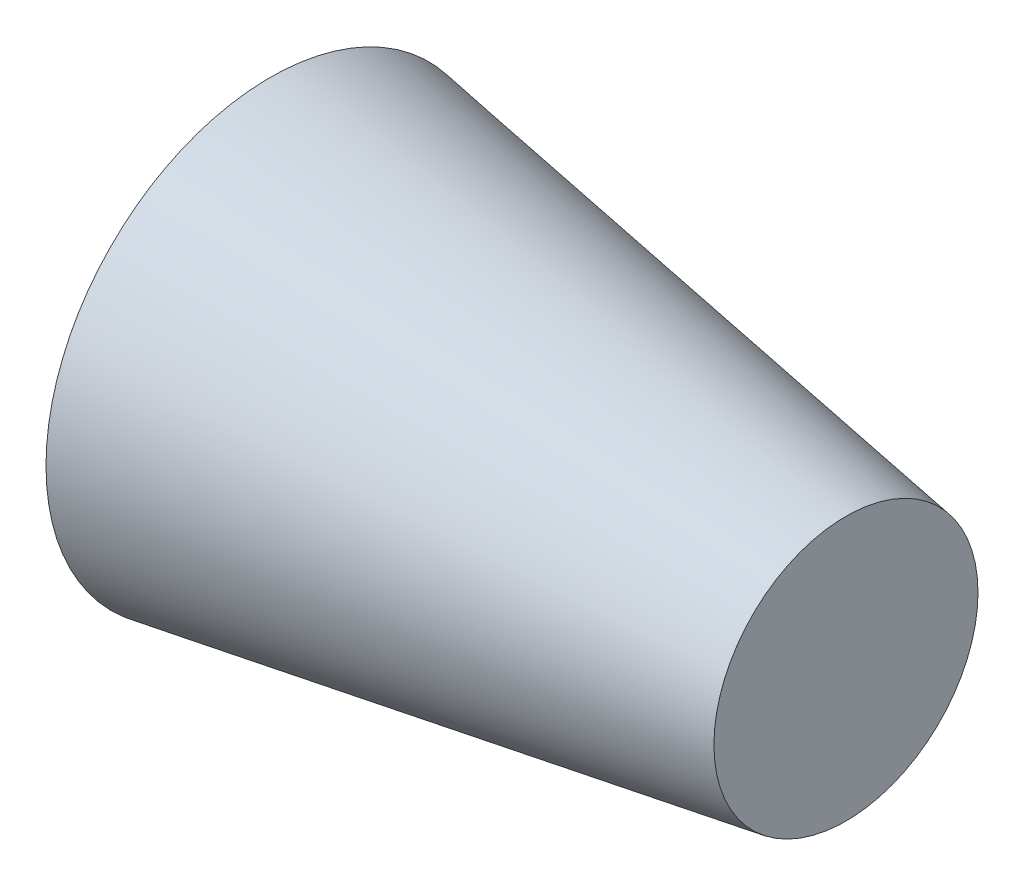
ISO-10303-21;
HEADER;
FILE_DESCRIPTION(('STEP AP214'),'2;1');
FILE_NAME('part.step','',(''),(''),'','','');
FILE_SCHEMA(('AUTOMOTIVE_DESIGN { 1 0 10303 214 1 1 1 1 }'));
ENDSEC;
DATA;
#1=APPLICATION_CONTEXT('core data for automotive mechanical design processes');
#2=APPLICATION_PROTOCOL_DEFINITION('international standard','automotive_design',2000,#1);
#3=PRODUCT_CONTEXT('',#1,'mechanical');
#4=PRODUCT('Part','Part','',(#3));
#5=PRODUCT_RELATED_PRODUCT_CATEGORY('part','',(#4));
#6=PRODUCT_DEFINITION_FORMATION('','',#4);
#7=PRODUCT_DEFINITION_CONTEXT('part definition',#1,'design');
#8=PRODUCT_DEFINITION('design','',#6,#7);
#9=PRODUCT_DEFINITION_SHAPE('','',#8);
#10=(LENGTH_UNIT() NAMED_UNIT(*) SI_UNIT(.MILLI.,.METRE.));
#11=(NAMED_UNIT(*) PLANE_ANGLE_UNIT() SI_UNIT($,.RADIAN.));
#12=(NAMED_UNIT(*) SI_UNIT($,.STERADIAN.) SOLID_ANGLE_UNIT());
#13=UNCERTAINTY_MEASURE_WITH_UNIT(LENGTH_MEASURE(1.E-05),#10,'distance_accuracy_value','');
#14=(GEOMETRIC_REPRESENTATION_CONTEXT(3) GLOBAL_UNCERTAINTY_ASSIGNED_CONTEXT((#13)) GLOBAL_UNIT_ASSIGNED_CONTEXT((#10,
#11,#12)) REPRESENTATION_CONTEXT('',''));
#15=CARTESIAN_POINT('',(0.,0.,0.));
#16=DIRECTION('',(0.,0.,1.));
#17=DIRECTION('',(1.,0.,0.));
#18=AXIS2_PLACEMENT_3D('',#15,#16,#17);
#19=CARTESIAN_POINT('',(17192.2398666314,0.,0.));
#20=DIRECTION('',(1.,0.,0.));
#21=DIRECTION('',(0.,0.,-1.));
#22=AXIS2_PLACEMENT_3D('',#19,#20,#21);
#23=PLANE('',#22);
#24=CARTESIAN_POINT('',(17192.2398666314,163.108100160094,0.));
#25=DIRECTION('',(-1.,0.,0.));
#26=DIRECTION('',(0.,0.,1.));
#27=AXIS2_PLACEMENT_3D('',#24,#25,#26);
#28=CIRCLE('',#27,1130.49401701701);
#29=CARTESIAN_POINT('',(17192.2398666314,163.108100160094,1130.49401701701));
#30=VERTEX_POINT('',#29);
#31=EDGE_CURVE('E37',#30,#30,#28,.T.);
#32=ORIENTED_EDGE('',*,*,#31,.T.);
#33=EDGE_LOOP('',(#32));
#34=FACE_BOUND('',#33,.T.);
#35=ADVANCED_FACE('F31',(#34),#23,.F.);
#36=CARTESIAN_POINT('',(20094.5354869192,0.,0.));
#37=DIRECTION('',(-1.,0.,0.));
#38=DIRECTION('',(0.,0.,1.));
#39=AXIS2_PLACEMENT_3D('',#36,#37,#38);
#40=PLANE('',#39);
#41=CARTESIAN_POINT('',(20094.5354869192,163.108100160094,0.));
#42=DIRECTION('',(-1.,0.,0.));
#43=DIRECTION('',(0.,0.,1.));
#44=AXIS2_PLACEMENT_3D('',#41,#42,#43);
#45=CIRCLE('',#44,665.656656286857);
#46=CARTESIAN_POINT('',(20094.5354869192,163.108100160094,665.656656286857));
#47=VERTEX_POINT('',#46);
#48=EDGE_CURVE('E10',#47,#47,#45,.T.);
#49=ORIENTED_EDGE('',*,*,#48,.F.);
#50=EDGE_LOOP('',(#49));
#51=FACE_BOUND('',#50,.T.);
#52=ADVANCED_FACE('F46',(#51),#40,.F.);
#53=CARTESIAN_POINT('',(20094.5354869192,163.108100160094,0.));
#54=DIRECTION('',(-1.,0.,0.));
#55=DIRECTION('',(0.,0.,1.));
#56=AXIS2_PLACEMENT_3D('',#53,#54,#55);
#57=CONICAL_SURFACE('',#56,665.656656286857,0.158813177421775);
#58=ORIENTED_EDGE('',*,*,#31,.F.);
#59=EDGE_LOOP('',(#58));
#60=FACE_BOUND('',#59,.T.);
#61=ORIENTED_EDGE('',*,*,#48,.T.);
#62=EDGE_LOOP('',(#61));
#63=FACE_BOUND('',#62,.T.);
#64=ADVANCED_FACE('F44',(#60,#63),#57,.T.);
#65=CLOSED_SHELL('',(#35,#52,#64));
#66=MANIFOLD_SOLID_BREP('B2',#65);
#67=ADVANCED_BREP_SHAPE_REPRESENTATION('',(#18,#66),#14);
#68=SHAPE_DEFINITION_REPRESENTATION(#9,#67);
ENDSEC;
END-ISO-10303-21;
